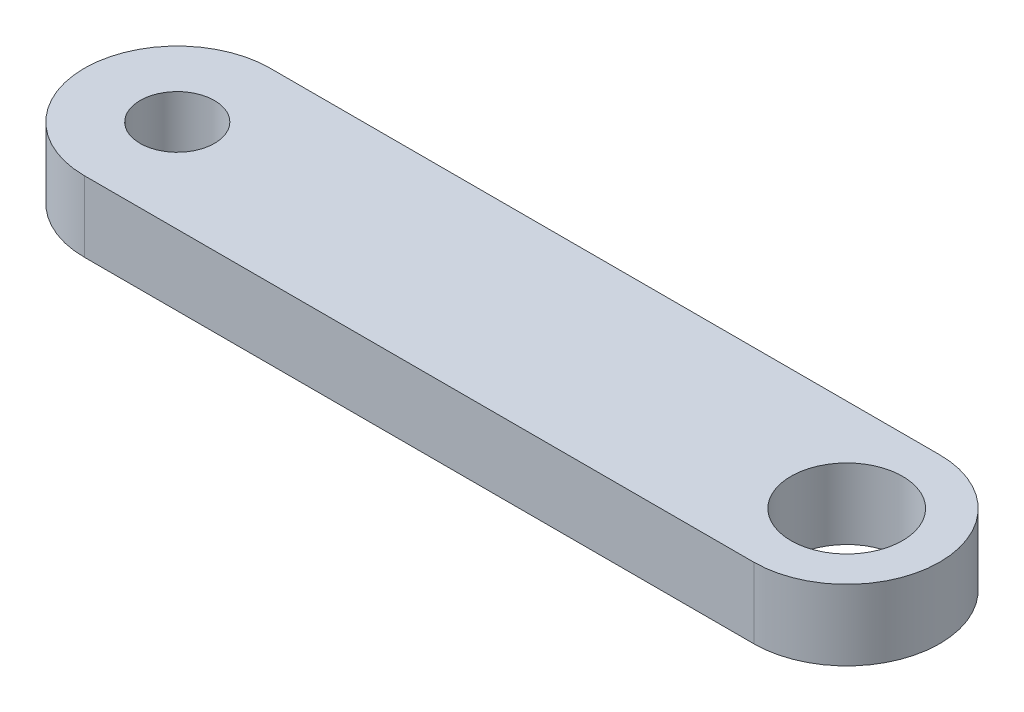
ISO-10303-21;
HEADER;
FILE_DESCRIPTION(('STEP AP214'),'2;1');
FILE_NAME('part.step','',(''),(''),'','','');
FILE_SCHEMA(('AUTOMOTIVE_DESIGN { 1 0 10303 214 1 1 1 1 }'));
ENDSEC;
DATA;
#1=APPLICATION_CONTEXT('core data for automotive mechanical design processes');
#2=APPLICATION_PROTOCOL_DEFINITION('international standard','automotive_design',2000,#1);
#3=PRODUCT_CONTEXT('',#1,'mechanical');
#4=PRODUCT('Part','Part','',(#3));
#5=PRODUCT_RELATED_PRODUCT_CATEGORY('part','',(#4));
#6=PRODUCT_DEFINITION_FORMATION('','',#4);
#7=PRODUCT_DEFINITION_CONTEXT('part definition',#1,'design');
#8=PRODUCT_DEFINITION('design','',#6,#7);
#9=PRODUCT_DEFINITION_SHAPE('','',#8);
#10=(LENGTH_UNIT() NAMED_UNIT(*) SI_UNIT(.MILLI.,.METRE.));
#11=(NAMED_UNIT(*) PLANE_ANGLE_UNIT() SI_UNIT($,.RADIAN.));
#12=(NAMED_UNIT(*) SI_UNIT($,.STERADIAN.) SOLID_ANGLE_UNIT());
#13=UNCERTAINTY_MEASURE_WITH_UNIT(LENGTH_MEASURE(1.E-05),#10,'distance_accuracy_value','');
#14=(GEOMETRIC_REPRESENTATION_CONTEXT(3) GLOBAL_UNCERTAINTY_ASSIGNED_CONTEXT((#13)) GLOBAL_UNIT_ASSIGNED_CONTEXT((#10,
#11,#12)) REPRESENTATION_CONTEXT('',''));
#15=CARTESIAN_POINT('',(0.,0.,0.));
#16=DIRECTION('',(0.,0.,1.));
#17=DIRECTION('',(1.,0.,0.));
#18=AXIS2_PLACEMENT_3D('',#15,#16,#17);
#19=CARTESIAN_POINT('',(-9.,0.,0.));
#20=DIRECTION('',(0.,1.,0.));
#21=DIRECTION('',(0.,0.,1.));
#22=AXIS2_PLACEMENT_3D('',#19,#20,#21);
#23=CYLINDRICAL_SURFACE('',#22,1.);
#24=CARTESIAN_POINT('',(-9.,1.9,0.));
#25=DIRECTION('',(0.,1.,0.));
#26=DIRECTION('',(0.,0.,1.));
#27=AXIS2_PLACEMENT_3D('',#24,#25,#26);
#28=CIRCLE('',#27,1.);
#29=CARTESIAN_POINT('',(-9.,1.9,1.));
#30=VERTEX_POINT('',#29);
#31=EDGE_CURVE('E11',#30,#30,#28,.T.);
#32=ORIENTED_EDGE('',*,*,#31,.T.);
#33=EDGE_LOOP('',(#32));
#34=FACE_BOUND('',#33,.T.);
#35=CARTESIAN_POINT('',(-9.,0.,0.));
#36=DIRECTION('',(0.,1.,0.));
#37=DIRECTION('',(0.,0.,1.));
#38=AXIS2_PLACEMENT_3D('',#35,#36,#37);
#39=CIRCLE('',#38,1.);
#40=CARTESIAN_POINT('',(-9.,0.,1.));
#41=VERTEX_POINT('',#40);
#42=EDGE_CURVE('E80',#41,#41,#39,.T.);
#43=ORIENTED_EDGE('',*,*,#42,.F.);
#44=EDGE_LOOP('',(#43));
#45=FACE_BOUND('',#44,.T.);
#46=ADVANCED_FACE('F17',(#34,#45),#23,.F.);
#47=CARTESIAN_POINT('',(9.,0.,0.));
#48=DIRECTION('',(0.,1.,0.));
#49=DIRECTION('',(0.,0.,1.));
#50=AXIS2_PLACEMENT_3D('',#47,#48,#49);
#51=CYLINDRICAL_SURFACE('',#50,1.5);
#52=CARTESIAN_POINT('',(9.,1.9,0.));
#53=DIRECTION('',(0.,1.,0.));
#54=DIRECTION('',(0.,0.,1.));
#55=AXIS2_PLACEMENT_3D('',#52,#53,#54);
#56=CIRCLE('',#55,1.5);
#57=CARTESIAN_POINT('',(9.,1.9,1.49999999999999));
#58=VERTEX_POINT('',#57);
#59=EDGE_CURVE('E27',#58,#58,#56,.T.);
#60=ORIENTED_EDGE('',*,*,#59,.T.);
#61=EDGE_LOOP('',(#60));
#62=FACE_BOUND('',#61,.T.);
#63=CARTESIAN_POINT('',(9.,0.,0.));
#64=DIRECTION('',(0.,1.,0.));
#65=DIRECTION('',(0.,0.,1.));
#66=AXIS2_PLACEMENT_3D('',#63,#64,#65);
#67=CIRCLE('',#66,1.5);
#68=CARTESIAN_POINT('',(9.,0.,1.49999999999999));
#69=VERTEX_POINT('',#68);
#70=EDGE_CURVE('E82',#69,#69,#67,.T.);
#71=ORIENTED_EDGE('',*,*,#70,.F.);
#72=EDGE_LOOP('',(#71));
#73=FACE_BOUND('',#72,.T.);
#74=ADVANCED_FACE('F115',(#62,#73),#51,.F.);
#75=CARTESIAN_POINT('',(9.,1.9,0.));
#76=DIRECTION('',(0.,-1.,0.));
#77=DIRECTION('',(0.,0.,-1.));
#78=AXIS2_PLACEMENT_3D('',#75,#76,#77);
#79=CYLINDRICAL_SURFACE('',#78,2.5);
#80=CARTESIAN_POINT('',(9.,0.,0.));
#81=DIRECTION('',(0.,1.,0.));
#82=DIRECTION('',(0.,0.,1.));
#83=AXIS2_PLACEMENT_3D('',#80,#81,#82);
#84=CIRCLE('',#83,2.5);
#85=CARTESIAN_POINT('',(9.,0.,2.49999999999999));
#86=VERTEX_POINT('',#85);
#87=CARTESIAN_POINT('',(9.,0.,-2.50000000000001));
#88=VERTEX_POINT('',#87);
#89=EDGE_CURVE('E91',#86,#88,#84,.T.);
#90=ORIENTED_EDGE('',*,*,#89,.T.);
#91=DIRECTION('',(0.,-1.,0.));
#92=VECTOR('',#91,1.);
#93=CARTESIAN_POINT('',(9.,1.9,-2.50000000000001));
#94=LINE('',#93,#92);
#95=CARTESIAN_POINT('',(9.,1.9,-2.50000000000001));
#96=VERTEX_POINT('',#95);
#97=EDGE_CURVE('E36',#96,#88,#94,.T.);
#98=ORIENTED_EDGE('',*,*,#97,.F.);
#99=CARTESIAN_POINT('',(9.,1.9,0.));
#100=DIRECTION('',(0.,1.,0.));
#101=DIRECTION('',(0.,0.,1.));
#102=AXIS2_PLACEMENT_3D('',#99,#100,#101);
#103=CIRCLE('',#102,2.5);
#104=CARTESIAN_POINT('',(9.,1.9,2.49999999999999));
#105=VERTEX_POINT('',#104);
#106=EDGE_CURVE('E74',#105,#96,#103,.T.);
#107=ORIENTED_EDGE('',*,*,#106,.F.);
#108=DIRECTION('',(0.,-1.,0.));
#109=VECTOR('',#108,1.);
#110=CARTESIAN_POINT('',(9.,1.9,2.49999999999999));
#111=LINE('',#110,#109);
#112=EDGE_CURVE('E79',#105,#86,#111,.T.);
#113=ORIENTED_EDGE('',*,*,#112,.T.);
#114=EDGE_LOOP('',(#90,#98,#107,#113));
#115=FACE_BOUND('',#114,.T.);
#116=ADVANCED_FACE('F105',(#115),#79,.T.);
#117=CARTESIAN_POINT('',(9.,1.9,-2.50000000000001));
#118=DIRECTION('',(0.,0.,1.));
#119=DIRECTION('',(1.,0.,0.));
#120=AXIS2_PLACEMENT_3D('',#117,#118,#119);
#121=PLANE('',#120);
#122=DIRECTION('',(-1.,0.,0.));
#123=VECTOR('',#122,1.);
#124=CARTESIAN_POINT('',(9.,0.,-2.50000000000001));
#125=LINE('',#124,#123);
#126=CARTESIAN_POINT('',(-9.,0.,-2.5));
#127=VERTEX_POINT('',#126);
#128=EDGE_CURVE('E94',#88,#127,#125,.T.);
#129=ORIENTED_EDGE('',*,*,#128,.T.);
#130=DIRECTION('',(0.,-1.,0.));
#131=VECTOR('',#130,1.);
#132=CARTESIAN_POINT('',(-9.,1.9,-2.5));
#133=LINE('',#132,#131);
#134=CARTESIAN_POINT('',(-9.,1.9,-2.5));
#135=VERTEX_POINT('',#134);
#136=EDGE_CURVE('E98',#135,#127,#133,.T.);
#137=ORIENTED_EDGE('',*,*,#136,.F.);
#138=DIRECTION('',(-1.,0.,0.));
#139=VECTOR('',#138,1.);
#140=CARTESIAN_POINT('',(9.,1.9,-2.50000000000001));
#141=LINE('',#140,#139);
#142=EDGE_CURVE('E65',#96,#135,#141,.T.);
#143=ORIENTED_EDGE('',*,*,#142,.F.);
#144=ORIENTED_EDGE('',*,*,#97,.T.);
#145=EDGE_LOOP('',(#129,#137,#143,#144));
#146=FACE_BOUND('',#145,.T.);
#147=ADVANCED_FACE('F106',(#146),#121,.F.);
#148=CARTESIAN_POINT('',(-9.,1.9,0.));
#149=DIRECTION('',(0.,-1.,0.));
#150=DIRECTION('',(0.,0.,-1.));
#151=AXIS2_PLACEMENT_3D('',#148,#149,#150);
#152=CYLINDRICAL_SURFACE('',#151,2.5);
#153=CARTESIAN_POINT('',(-9.,0.,0.));
#154=DIRECTION('',(0.,1.,0.));
#155=DIRECTION('',(0.,0.,1.));
#156=AXIS2_PLACEMENT_3D('',#153,#154,#155);
#157=CIRCLE('',#156,2.5);
#158=CARTESIAN_POINT('',(-9.,0.,2.5));
#159=VERTEX_POINT('',#158);
#160=EDGE_CURVE('E71',#127,#159,#157,.T.);
#161=ORIENTED_EDGE('',*,*,#160,.T.);
#162=DIRECTION('',(0.,-1.,0.));
#163=VECTOR('',#162,1.);
#164=CARTESIAN_POINT('',(-9.,1.9,2.5));
#165=LINE('',#164,#163);
#166=CARTESIAN_POINT('',(-9.,1.9,2.5));
#167=VERTEX_POINT('',#166);
#168=EDGE_CURVE('E57',#167,#159,#165,.T.);
#169=ORIENTED_EDGE('',*,*,#168,.F.);
#170=CARTESIAN_POINT('',(-9.,1.9,0.));
#171=DIRECTION('',(0.,1.,0.));
#172=DIRECTION('',(0.,0.,1.));
#173=AXIS2_PLACEMENT_3D('',#170,#171,#172);
#174=CIRCLE('',#173,2.5);
#175=EDGE_CURVE('E63',#135,#167,#174,.T.);
#176=ORIENTED_EDGE('',*,*,#175,.F.);
#177=ORIENTED_EDGE('',*,*,#136,.T.);
#178=EDGE_LOOP('',(#161,#169,#176,#177));
#179=FACE_BOUND('',#178,.T.);
#180=ADVANCED_FACE('F69',(#179),#152,.T.);
#181=CARTESIAN_POINT('',(9.,1.9,2.49999999999999));
#182=DIRECTION('',(0.,0.,-1.));
#183=DIRECTION('',(-1.,0.,0.));
#184=AXIS2_PLACEMENT_3D('',#181,#182,#183);
#185=PLANE('',#184);
#186=DIRECTION('',(1.,0.,0.));
#187=VECTOR('',#186,1.);
#188=CARTESIAN_POINT('',(9.,0.,2.49999999999999));
#189=LINE('',#188,#187);
#190=EDGE_CURVE('E73',#159,#86,#189,.T.);
#191=ORIENTED_EDGE('',*,*,#190,.T.);
#192=ORIENTED_EDGE('',*,*,#112,.F.);
#193=DIRECTION('',(1.,0.,0.));
#194=VECTOR('',#193,1.);
#195=CARTESIAN_POINT('',(9.,1.9,2.49999999999999));
#196=LINE('',#195,#194);
#197=EDGE_CURVE('E21',#167,#105,#196,.T.);
#198=ORIENTED_EDGE('',*,*,#197,.F.);
#199=ORIENTED_EDGE('',*,*,#168,.T.);
#200=EDGE_LOOP('',(#191,#192,#198,#199));
#201=FACE_BOUND('',#200,.T.);
#202=ADVANCED_FACE('F77',(#201),#185,.F.);
#203=CARTESIAN_POINT('',(9.,1.9,0.));
#204=DIRECTION('',(0.,1.,0.));
#205=DIRECTION('',(0.,0.,1.));
#206=AXIS2_PLACEMENT_3D('',#203,#204,#205);
#207=PLANE('',#206);
#208=ORIENTED_EDGE('',*,*,#31,.F.);
#209=EDGE_LOOP('',(#208));
#210=FACE_BOUND('',#209,.T.);
#211=ORIENTED_EDGE('',*,*,#59,.F.);
#212=EDGE_LOOP('',(#211));
#213=FACE_BOUND('',#212,.T.);
#214=ORIENTED_EDGE('',*,*,#106,.T.);
#215=ORIENTED_EDGE('',*,*,#142,.T.);
#216=ORIENTED_EDGE('',*,*,#175,.T.);
#217=ORIENTED_EDGE('',*,*,#197,.T.);
#218=EDGE_LOOP('',(#214,#215,#216,#217));
#219=FACE_BOUND('',#218,.T.);
#220=ADVANCED_FACE('F64',(#210,#213,#219),#207,.T.);
#221=CARTESIAN_POINT('',(9.,0.,0.));
#222=DIRECTION('',(0.,1.,0.));
#223=DIRECTION('',(0.,0.,1.));
#224=AXIS2_PLACEMENT_3D('',#221,#222,#223);
#225=PLANE('',#224);
#226=ORIENTED_EDGE('',*,*,#42,.T.);
#227=EDGE_LOOP('',(#226));
#228=FACE_BOUND('',#227,.T.);
#229=ORIENTED_EDGE('',*,*,#70,.T.);
#230=EDGE_LOOP('',(#229));
#231=FACE_BOUND('',#230,.T.);
#232=ORIENTED_EDGE('',*,*,#89,.F.);
#233=ORIENTED_EDGE('',*,*,#190,.F.);
#234=ORIENTED_EDGE('',*,*,#160,.F.);
#235=ORIENTED_EDGE('',*,*,#128,.F.);
#236=EDGE_LOOP('',(#232,#233,#234,#235));
#237=FACE_BOUND('',#236,.T.);
#238=ADVANCED_FACE('F19',(#228,#231,#237),#225,.F.);
#239=CLOSED_SHELL('',(#46,#74,#116,#147,#180,#202,#220,#238));
#240=MANIFOLD_SOLID_BREP('B1',#239);
#241=ADVANCED_BREP_SHAPE_REPRESENTATION('',(#18,#240),#14);
#242=SHAPE_DEFINITION_REPRESENTATION(#9,#241);
ENDSEC;
END-ISO-10303-21;
